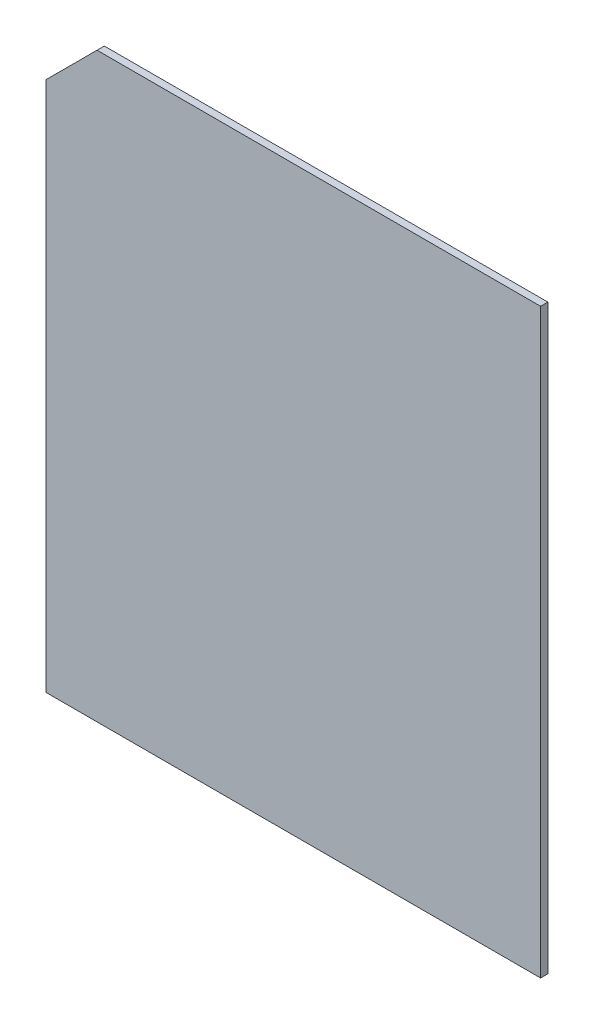
ISO-10303-21;
HEADER;
FILE_DESCRIPTION(('STEP AP214'),'2;1');
FILE_NAME('part.step','',(''),(''),'','','');
FILE_SCHEMA(('AUTOMOTIVE_DESIGN { 1 0 10303 214 1 1 1 1 }'));
ENDSEC;
DATA;
#1=APPLICATION_CONTEXT('core data for automotive mechanical design processes');
#2=APPLICATION_PROTOCOL_DEFINITION('international standard','automotive_design',2000,#1);
#3=PRODUCT_CONTEXT('',#1,'mechanical');
#4=PRODUCT('Part','Part','',(#3));
#5=PRODUCT_RELATED_PRODUCT_CATEGORY('part','',(#4));
#6=PRODUCT_DEFINITION_FORMATION('','',#4);
#7=PRODUCT_DEFINITION_CONTEXT('part definition',#1,'design');
#8=PRODUCT_DEFINITION('design','',#6,#7);
#9=PRODUCT_DEFINITION_SHAPE('','',#8);
#10=(LENGTH_UNIT() NAMED_UNIT(*) SI_UNIT(.MILLI.,.METRE.));
#11=(NAMED_UNIT(*) PLANE_ANGLE_UNIT() SI_UNIT($,.RADIAN.));
#12=(NAMED_UNIT(*) SI_UNIT($,.STERADIAN.) SOLID_ANGLE_UNIT());
#13=UNCERTAINTY_MEASURE_WITH_UNIT(LENGTH_MEASURE(1.E-05),#10,'distance_accuracy_value','');
#14=(GEOMETRIC_REPRESENTATION_CONTEXT(3) GLOBAL_UNCERTAINTY_ASSIGNED_CONTEXT((#13)) GLOBAL_UNIT_ASSIGNED_CONTEXT((#10,
#11,#12)) REPRESENTATION_CONTEXT('',''));
#15=CARTESIAN_POINT('',(0.,0.,0.));
#16=DIRECTION('',(0.,0.,1.));
#17=DIRECTION('',(1.,0.,0.));
#18=AXIS2_PLACEMENT_3D('',#15,#16,#17);
#19=CARTESIAN_POINT('',(0.,0.,0.05));
#20=DIRECTION('',(0.,0.,-1.));
#21=DIRECTION('',(0.,-1.,0.));
#22=AXIS2_PLACEMENT_3D('',#19,#20,#21);
#23=PLANE('',#22);
#24=DIRECTION('',(1.,0.,0.));
#25=VECTOR('',#24,1.);
#26=CARTESIAN_POINT('',(0.,0.,0.05));
#27=LINE('',#26,#25);
#28=CARTESIAN_POINT('',(0.,0.,0.05));
#29=VERTEX_POINT('',#28);
#30=CARTESIAN_POINT('',(3.4,0.,0.05));
#31=VERTEX_POINT('',#30);
#32=EDGE_CURVE('E88',#29,#31,#27,.T.);
#33=ORIENTED_EDGE('',*,*,#32,.T.);
#34=DIRECTION('',(0.,1.,0.));
#35=VECTOR('',#34,1.);
#36=CARTESIAN_POINT('',(3.4,0.,0.05));
#37=LINE('',#36,#35);
#38=CARTESIAN_POINT('',(3.4,4.,0.05));
#39=VERTEX_POINT('',#38);
#40=EDGE_CURVE('E117',#31,#39,#37,.T.);
#41=ORIENTED_EDGE('',*,*,#40,.T.);
#42=DIRECTION('',(-1.,0.,0.));
#43=VECTOR('',#42,1.);
#44=CARTESIAN_POINT('',(3.4,4.,0.05));
#45=LINE('',#44,#43);
#46=CARTESIAN_POINT('',(0.35,4.,0.05));
#47=VERTEX_POINT('',#46);
#48=EDGE_CURVE('E110',#39,#47,#45,.T.);
#49=ORIENTED_EDGE('',*,*,#48,.T.);
#50=DIRECTION('',(-0.707106781186548,-0.707106781186548,0.));
#51=VECTOR('',#50,1.);
#52=CARTESIAN_POINT('',(0.35,4.,0.05));
#53=LINE('',#52,#51);
#54=CARTESIAN_POINT('',(0.,3.65,0.05));
#55=VERTEX_POINT('',#54);
#56=EDGE_CURVE('E81',#47,#55,#53,.T.);
#57=ORIENTED_EDGE('',*,*,#56,.T.);
#58=DIRECTION('',(0.,-1.,0.));
#59=VECTOR('',#58,1.);
#60=CARTESIAN_POINT('',(0.,3.65,0.05));
#61=LINE('',#60,#59);
#62=EDGE_CURVE('E11',#55,#29,#61,.T.);
#63=ORIENTED_EDGE('',*,*,#62,.T.);
#64=EDGE_LOOP('',(#33,#41,#49,#57,#63));
#65=FACE_BOUND('',#64,.T.);
#66=ADVANCED_FACE('F17',(#65),#23,.F.);
#67=CARTESIAN_POINT('',(0.,0.,0.));
#68=DIRECTION('',(0.,0.,-1.));
#69=DIRECTION('',(0.,-1.,0.));
#70=AXIS2_PLACEMENT_3D('',#67,#68,#69);
#71=PLANE('',#70);
#72=DIRECTION('',(0.,-1.,0.));
#73=VECTOR('',#72,1.);
#74=CARTESIAN_POINT('',(0.,3.65,0.));
#75=LINE('',#74,#73);
#76=CARTESIAN_POINT('',(0.,3.65,0.));
#77=VERTEX_POINT('',#76);
#78=CARTESIAN_POINT('',(0.,0.,0.));
#79=VERTEX_POINT('',#78);
#80=EDGE_CURVE('E21',#77,#79,#75,.T.);
#81=ORIENTED_EDGE('',*,*,#80,.F.);
#82=DIRECTION('',(-0.707106781186548,-0.707106781186548,0.));
#83=VECTOR('',#82,1.);
#84=CARTESIAN_POINT('',(0.35,4.,0.));
#85=LINE('',#84,#83);
#86=CARTESIAN_POINT('',(0.35,4.,0.));
#87=VERTEX_POINT('',#86);
#88=EDGE_CURVE('E107',#87,#77,#85,.T.);
#89=ORIENTED_EDGE('',*,*,#88,.F.);
#90=DIRECTION('',(-1.,0.,0.));
#91=VECTOR('',#90,1.);
#92=CARTESIAN_POINT('',(3.4,4.,0.));
#93=LINE('',#92,#91);
#94=CARTESIAN_POINT('',(3.4,4.,0.));
#95=VERTEX_POINT('',#94);
#96=EDGE_CURVE('E122',#95,#87,#93,.T.);
#97=ORIENTED_EDGE('',*,*,#96,.F.);
#98=DIRECTION('',(0.,1.,0.));
#99=VECTOR('',#98,1.);
#100=CARTESIAN_POINT('',(3.4,0.,0.));
#101=LINE('',#100,#99);
#102=CARTESIAN_POINT('',(3.4,0.,0.));
#103=VERTEX_POINT('',#102);
#104=EDGE_CURVE('E90',#103,#95,#101,.T.);
#105=ORIENTED_EDGE('',*,*,#104,.F.);
#106=DIRECTION('',(1.,0.,0.));
#107=VECTOR('',#106,1.);
#108=CARTESIAN_POINT('',(0.,0.,0.));
#109=LINE('',#108,#107);
#110=EDGE_CURVE('E86',#79,#103,#109,.T.);
#111=ORIENTED_EDGE('',*,*,#110,.F.);
#112=EDGE_LOOP('',(#81,#89,#97,#105,#111));
#113=FACE_BOUND('',#112,.T.);
#114=ADVANCED_FACE('F19',(#113),#71,.T.);
#115=CARTESIAN_POINT('',(0.,3.65,0.));
#116=DIRECTION('',(1.,0.,0.));
#117=DIRECTION('',(0.,1.,0.));
#118=AXIS2_PLACEMENT_3D('',#115,#116,#117);
#119=PLANE('',#118);
#120=ORIENTED_EDGE('',*,*,#80,.T.);
#121=DIRECTION('',(0.,0.,1.));
#122=VECTOR('',#121,1.);
#123=CARTESIAN_POINT('',(0.,0.,0.));
#124=LINE('',#123,#122);
#125=EDGE_CURVE('E73',#79,#29,#124,.T.);
#126=ORIENTED_EDGE('',*,*,#125,.T.);
#127=ORIENTED_EDGE('',*,*,#62,.F.);
#128=DIRECTION('',(0.,0.,1.));
#129=VECTOR('',#128,1.);
#130=CARTESIAN_POINT('',(0.,3.65,0.));
#131=LINE('',#130,#129);
#132=EDGE_CURVE('E76',#77,#55,#131,.T.);
#133=ORIENTED_EDGE('',*,*,#132,.F.);
#134=EDGE_LOOP('',(#120,#126,#127,#133));
#135=FACE_BOUND('',#134,.T.);
#136=ADVANCED_FACE('F72',(#135),#119,.F.);
#137=CARTESIAN_POINT('',(0.35,4.,0.));
#138=DIRECTION('',(0.707106781186548,-0.707106781186548,0.));
#139=DIRECTION('',(0.,0.,-1.));
#140=AXIS2_PLACEMENT_3D('',#137,#138,#139);
#141=PLANE('',#140);
#142=ORIENTED_EDGE('',*,*,#88,.T.);
#143=ORIENTED_EDGE('',*,*,#132,.T.);
#144=ORIENTED_EDGE('',*,*,#56,.F.);
#145=DIRECTION('',(0.,0.,1.));
#146=VECTOR('',#145,1.);
#147=CARTESIAN_POINT('',(0.35,4.,0.));
#148=LINE('',#147,#146);
#149=EDGE_CURVE('E118',#87,#47,#148,.T.);
#150=ORIENTED_EDGE('',*,*,#149,.F.);
#151=EDGE_LOOP('',(#142,#143,#144,#150));
#152=FACE_BOUND('',#151,.T.);
#153=ADVANCED_FACE('F141',(#152),#141,.F.);
#154=CARTESIAN_POINT('',(3.4,4.,0.));
#155=DIRECTION('',(0.,-1.,0.));
#156=DIRECTION('',(0.,0.,-1.));
#157=AXIS2_PLACEMENT_3D('',#154,#155,#156);
#158=PLANE('',#157);
#159=ORIENTED_EDGE('',*,*,#96,.T.);
#160=ORIENTED_EDGE('',*,*,#149,.T.);
#161=ORIENTED_EDGE('',*,*,#48,.F.);
#162=DIRECTION('',(0.,0.,1.));
#163=VECTOR('',#162,1.);
#164=CARTESIAN_POINT('',(3.4,4.,0.));
#165=LINE('',#164,#163);
#166=EDGE_CURVE('E113',#95,#39,#165,.T.);
#167=ORIENTED_EDGE('',*,*,#166,.F.);
#168=EDGE_LOOP('',(#159,#160,#161,#167));
#169=FACE_BOUND('',#168,.T.);
#170=ADVANCED_FACE('F139',(#169),#158,.F.);
#171=CARTESIAN_POINT('',(3.4,0.,0.));
#172=DIRECTION('',(-1.,0.,0.));
#173=DIRECTION('',(0.,0.,1.));
#174=AXIS2_PLACEMENT_3D('',#171,#172,#173);
#175=PLANE('',#174);
#176=ORIENTED_EDGE('',*,*,#104,.T.);
#177=ORIENTED_EDGE('',*,*,#166,.T.);
#178=ORIENTED_EDGE('',*,*,#40,.F.);
#179=DIRECTION('',(0.,0.,1.));
#180=VECTOR('',#179,1.);
#181=CARTESIAN_POINT('',(3.4,0.,0.));
#182=LINE('',#181,#180);
#183=EDGE_CURVE('E95',#103,#31,#182,.T.);
#184=ORIENTED_EDGE('',*,*,#183,.F.);
#185=EDGE_LOOP('',(#176,#177,#178,#184));
#186=FACE_BOUND('',#185,.T.);
#187=ADVANCED_FACE('F143',(#186),#175,.F.);
#188=CARTESIAN_POINT('',(0.,0.,0.));
#189=DIRECTION('',(0.,1.,0.));
#190=DIRECTION('',(1.,0.,0.));
#191=AXIS2_PLACEMENT_3D('',#188,#189,#190);
#192=PLANE('',#191);
#193=ORIENTED_EDGE('',*,*,#110,.T.);
#194=ORIENTED_EDGE('',*,*,#183,.T.);
#195=ORIENTED_EDGE('',*,*,#32,.F.);
#196=ORIENTED_EDGE('',*,*,#125,.F.);
#197=EDGE_LOOP('',(#193,#194,#195,#196));
#198=FACE_BOUND('',#197,.T.);
#199=ADVANCED_FACE('F84',(#198),#192,.F.);
#200=CLOSED_SHELL('',(#66,#114,#136,#153,#170,#187,#199));
#201=MANIFOLD_SOLID_BREP('B1',#200);
#202=ADVANCED_BREP_SHAPE_REPRESENTATION('',(#18,#201),#14);
#203=SHAPE_DEFINITION_REPRESENTATION(#9,#202);
ENDSEC;
END-ISO-10303-21;
